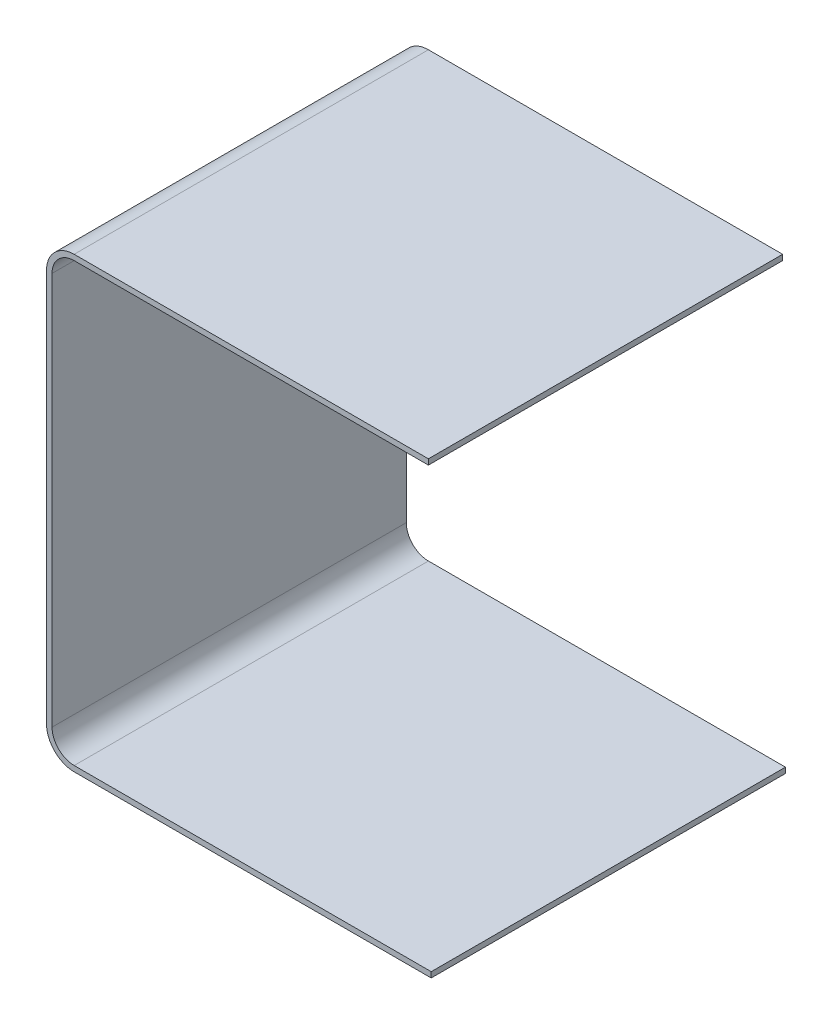
ISO-10303-21;
HEADER;
FILE_DESCRIPTION(('STEP AP214'),'2;1');
FILE_NAME('part.step','',(''),(''),'','','');
FILE_SCHEMA(('AUTOMOTIVE_DESIGN { 1 0 10303 214 1 1 1 1 }'));
ENDSEC;
DATA;
#1=APPLICATION_CONTEXT('core data for automotive mechanical design processes');
#2=APPLICATION_PROTOCOL_DEFINITION('international standard','automotive_design',2000,#1);
#3=PRODUCT_CONTEXT('',#1,'mechanical');
#4=PRODUCT('Part','Part','',(#3));
#5=PRODUCT_RELATED_PRODUCT_CATEGORY('part','',(#4));
#6=PRODUCT_DEFINITION_FORMATION('','',#4);
#7=PRODUCT_DEFINITION_CONTEXT('part definition',#1,'design');
#8=PRODUCT_DEFINITION('design','',#6,#7);
#9=PRODUCT_DEFINITION_SHAPE('','',#8);
#10=(LENGTH_UNIT() NAMED_UNIT(*) SI_UNIT(.MILLI.,.METRE.));
#11=(NAMED_UNIT(*) PLANE_ANGLE_UNIT() SI_UNIT($,.RADIAN.));
#12=(NAMED_UNIT(*) SI_UNIT($,.STERADIAN.) SOLID_ANGLE_UNIT());
#13=UNCERTAINTY_MEASURE_WITH_UNIT(LENGTH_MEASURE(1.E-05),#10,'distance_accuracy_value','');
#14=(GEOMETRIC_REPRESENTATION_CONTEXT(3) GLOBAL_UNCERTAINTY_ASSIGNED_CONTEXT((#13)) GLOBAL_UNIT_ASSIGNED_CONTEXT((#10,
#11,#12)) REPRESENTATION_CONTEXT('',''));
#15=CARTESIAN_POINT('',(0.,0.,0.));
#16=DIRECTION('',(0.,0.,1.));
#17=DIRECTION('',(1.,0.,0.));
#18=AXIS2_PLACEMENT_3D('',#15,#16,#17);
#19=CARTESIAN_POINT('',(261.709177450578,-64.28105,101.6));
#20=DIRECTION('',(0.,1.,0.));
#21=DIRECTION('',(0.,0.,1.));
#22=AXIS2_PLACEMENT_3D('',#19,#20,#21);
#23=PLANE('',#22);
#24=DIRECTION('',(1.,0.,0.));
#25=VECTOR('',#24,1.);
#26=CARTESIAN_POINT('',(261.709177450578,-64.28105,0.));
#27=LINE('',#26,#25);
#28=CARTESIAN_POINT('',(261.709177450578,-64.28105,0.));
#29=VERTEX_POINT('',#28);
#30=CARTESIAN_POINT('',(364.113827615954,-64.28105,0.));
#31=VERTEX_POINT('',#30);
#32=EDGE_CURVE('E122',#29,#31,#27,.T.);
#33=ORIENTED_EDGE('',*,*,#32,.T.);
#34=DIRECTION('',(0.,0.,-1.));
#35=VECTOR('',#34,1.);
#36=CARTESIAN_POINT('',(364.113827615954,-64.28105,101.6));
#37=LINE('',#36,#35);
#38=CARTESIAN_POINT('',(364.113827615954,-64.28105,101.6));
#39=VERTEX_POINT('',#38);
#40=EDGE_CURVE('E11',#39,#31,#37,.T.);
#41=ORIENTED_EDGE('',*,*,#40,.F.);
#42=DIRECTION('',(1.,0.,0.));
#43=VECTOR('',#42,1.);
#44=CARTESIAN_POINT('',(261.709177450578,-64.28105,101.6));
#45=LINE('',#44,#43);
#46=CARTESIAN_POINT('',(261.709177450578,-64.28105,101.6));
#47=VERTEX_POINT('',#46);
#48=EDGE_CURVE('E156',#47,#39,#45,.T.);
#49=ORIENTED_EDGE('',*,*,#48,.F.);
#50=DIRECTION('',(0.,0.,-1.));
#51=VECTOR('',#50,1.);
#52=CARTESIAN_POINT('',(261.709177450578,-64.28105,101.6));
#53=LINE('',#52,#51);
#54=EDGE_CURVE('E123',#47,#29,#53,.T.);
#55=ORIENTED_EDGE('',*,*,#54,.T.);
#56=EDGE_LOOP('',(#33,#41,#49,#55));
#57=FACE_BOUND('',#56,.T.);
#58=ADVANCED_FACE('F24',(#57),#23,.F.);
#59=CARTESIAN_POINT('',(364.113827615954,-62.70625,101.6));
#60=DIRECTION('',(1.,0.,0.));
#61=DIRECTION('',(0.,0.,-1.));
#62=AXIS2_PLACEMENT_3D('',#59,#60,#61);
#63=PLANE('',#62);
#64=DIRECTION('',(0.,-1.,0.));
#65=VECTOR('',#64,1.);
#66=CARTESIAN_POINT('',(364.113827615954,-62.70625,0.));
#67=LINE('',#66,#65);
#68=CARTESIAN_POINT('',(364.113827615954,-62.70625,0.));
#69=VERTEX_POINT('',#68);
#70=EDGE_CURVE('E114',#69,#31,#67,.T.);
#71=ORIENTED_EDGE('',*,*,#70,.F.);
#72=DIRECTION('',(0.,0.,-1.));
#73=VECTOR('',#72,1.);
#74=CARTESIAN_POINT('',(364.113827615954,-62.70625,101.6));
#75=LINE('',#74,#73);
#76=CARTESIAN_POINT('',(364.113827615954,-62.70625,101.6));
#77=VERTEX_POINT('',#76);
#78=EDGE_CURVE('E31',#77,#69,#75,.T.);
#79=ORIENTED_EDGE('',*,*,#78,.F.);
#80=DIRECTION('',(0.,-1.,0.));
#81=VECTOR('',#80,1.);
#82=CARTESIAN_POINT('',(364.113827615954,-62.70625,101.6));
#83=LINE('',#82,#81);
#84=EDGE_CURVE('E117',#77,#39,#83,.T.);
#85=ORIENTED_EDGE('',*,*,#84,.T.);
#86=ORIENTED_EDGE('',*,*,#40,.T.);
#87=EDGE_LOOP('',(#71,#79,#85,#86));
#88=FACE_BOUND('',#87,.T.);
#89=ADVANCED_FACE('F112',(#88),#63,.T.);
#90=CARTESIAN_POINT('',(261.709177450578,-62.70625,101.6));
#91=DIRECTION('',(0.,1.,0.));
#92=DIRECTION('',(0.,0.,1.));
#93=AXIS2_PLACEMENT_3D('',#90,#91,#92);
#94=PLANE('',#93);
#95=DIRECTION('',(1.,0.,0.));
#96=VECTOR('',#95,1.);
#97=CARTESIAN_POINT('',(261.709177450578,-62.70625,0.));
#98=LINE('',#97,#96);
#99=CARTESIAN_POINT('',(261.709177450578,-62.70625,0.));
#100=VERTEX_POINT('',#99);
#101=EDGE_CURVE('E130',#100,#69,#98,.T.);
#102=ORIENTED_EDGE('',*,*,#101,.F.);
#103=DIRECTION('',(0.,0.,-1.));
#104=VECTOR('',#103,1.);
#105=CARTESIAN_POINT('',(261.709177450578,-62.70625,101.6));
#106=LINE('',#105,#104);
#107=CARTESIAN_POINT('',(261.709177450578,-62.70625,101.6));
#108=VERTEX_POINT('',#107);
#109=EDGE_CURVE('E203',#108,#100,#106,.T.);
#110=ORIENTED_EDGE('',*,*,#109,.F.);
#111=DIRECTION('',(1.,0.,0.));
#112=VECTOR('',#111,1.);
#113=CARTESIAN_POINT('',(261.709177450578,-62.70625,101.6));
#114=LINE('',#113,#112);
#115=EDGE_CURVE('E159',#108,#77,#114,.T.);
#116=ORIENTED_EDGE('',*,*,#115,.T.);
#117=ORIENTED_EDGE('',*,*,#78,.T.);
#118=EDGE_LOOP('',(#102,#110,#116,#117));
#119=FACE_BOUND('',#118,.T.);
#120=ADVANCED_FACE('F205',(#119),#94,.T.);
#121=CARTESIAN_POINT('',(261.709177450578,-56.35625,101.6));
#122=DIRECTION('',(0.,0.,-1.));
#123=DIRECTION('',(-1.,0.,0.));
#124=AXIS2_PLACEMENT_3D('',#121,#122,#123);
#125=CYLINDRICAL_SURFACE('',#124,6.35000000000001);
#126=CARTESIAN_POINT('',(261.709177450578,-56.35625,0.));
#127=DIRECTION('',(0.,0.,1.));
#128=DIRECTION('',(1.,0.,0.));
#129=AXIS2_PLACEMENT_3D('',#126,#127,#128);
#130=CIRCLE('',#129,6.35000000000001);
#131=CARTESIAN_POINT('',(255.359177450578,-56.35625,0.));
#132=VERTEX_POINT('',#131);
#133=EDGE_CURVE('E132',#132,#100,#130,.T.);
#134=ORIENTED_EDGE('',*,*,#133,.F.);
#135=DIRECTION('',(0.,0.,-1.));
#136=VECTOR('',#135,1.);
#137=CARTESIAN_POINT('',(255.359177450578,-56.35625,101.6));
#138=LINE('',#137,#136);
#139=CARTESIAN_POINT('',(255.359177450578,-56.35625,101.6));
#140=VERTEX_POINT('',#139);
#141=EDGE_CURVE('E201',#140,#132,#138,.T.);
#142=ORIENTED_EDGE('',*,*,#141,.F.);
#143=CARTESIAN_POINT('',(261.709177450578,-56.35625,101.6));
#144=DIRECTION('',(0.,0.,1.));
#145=DIRECTION('',(1.,0.,0.));
#146=AXIS2_PLACEMENT_3D('',#143,#144,#145);
#147=CIRCLE('',#146,6.35000000000001);
#148=EDGE_CURVE('E162',#140,#108,#147,.T.);
#149=ORIENTED_EDGE('',*,*,#148,.T.);
#150=ORIENTED_EDGE('',*,*,#109,.T.);
#151=EDGE_LOOP('',(#134,#142,#149,#150));
#152=FACE_BOUND('',#151,.T.);
#153=ADVANCED_FACE('F212',(#152),#125,.F.);
#154=CARTESIAN_POINT('',(255.359177450578,56.35625,101.6));
#155=DIRECTION('',(1.,0.,0.));
#156=DIRECTION('',(0.,0.,-1.));
#157=AXIS2_PLACEMENT_3D('',#154,#155,#156);
#158=PLANE('',#157);
#159=DIRECTION('',(0.,-1.,0.));
#160=VECTOR('',#159,1.);
#161=CARTESIAN_POINT('',(255.359177450578,56.35625,0.));
#162=LINE('',#161,#160);
#163=CARTESIAN_POINT('',(255.359177450578,56.35625,0.));
#164=VERTEX_POINT('',#163);
#165=EDGE_CURVE('E136',#164,#132,#162,.T.);
#166=ORIENTED_EDGE('',*,*,#165,.F.);
#167=DIRECTION('',(0.,0.,-1.));
#168=VECTOR('',#167,1.);
#169=CARTESIAN_POINT('',(255.359177450578,56.35625,101.6));
#170=LINE('',#169,#168);
#171=CARTESIAN_POINT('',(255.359177450578,56.35625,101.6));
#172=VERTEX_POINT('',#171);
#173=EDGE_CURVE('E199',#172,#164,#170,.T.);
#174=ORIENTED_EDGE('',*,*,#173,.F.);
#175=DIRECTION('',(0.,-1.,0.));
#176=VECTOR('',#175,1.);
#177=CARTESIAN_POINT('',(255.359177450578,56.35625,101.6));
#178=LINE('',#177,#176);
#179=EDGE_CURVE('E165',#172,#140,#178,.T.);
#180=ORIENTED_EDGE('',*,*,#179,.T.);
#181=ORIENTED_EDGE('',*,*,#141,.T.);
#182=EDGE_LOOP('',(#166,#174,#180,#181));
#183=FACE_BOUND('',#182,.T.);
#184=ADVANCED_FACE('F215',(#183),#158,.T.);
#185=CARTESIAN_POINT('',(261.709177450578,56.35625,101.6));
#186=DIRECTION('',(0.,0.,-1.));
#187=DIRECTION('',(-1.,0.,0.));
#188=AXIS2_PLACEMENT_3D('',#185,#186,#187);
#189=CYLINDRICAL_SURFACE('',#188,6.35000000000002);
#190=CARTESIAN_POINT('',(261.709177450578,56.35625,0.));
#191=DIRECTION('',(0.,0.,1.));
#192=DIRECTION('',(1.,0.,0.));
#193=AXIS2_PLACEMENT_3D('',#190,#191,#192);
#194=CIRCLE('',#193,6.35000000000002);
#195=CARTESIAN_POINT('',(261.709177450578,62.70625,0.));
#196=VERTEX_POINT('',#195);
#197=EDGE_CURVE('E139',#196,#164,#194,.T.);
#198=ORIENTED_EDGE('',*,*,#197,.F.);
#199=DIRECTION('',(0.,0.,-1.));
#200=VECTOR('',#199,1.);
#201=CARTESIAN_POINT('',(261.709177450578,62.70625,101.6));
#202=LINE('',#201,#200);
#203=CARTESIAN_POINT('',(261.709177450578,62.70625,101.6));
#204=VERTEX_POINT('',#203);
#205=EDGE_CURVE('E197',#204,#196,#202,.T.);
#206=ORIENTED_EDGE('',*,*,#205,.F.);
#207=CARTESIAN_POINT('',(261.709177450578,56.35625,101.6));
#208=DIRECTION('',(0.,0.,1.));
#209=DIRECTION('',(1.,0.,0.));
#210=AXIS2_PLACEMENT_3D('',#207,#208,#209);
#211=CIRCLE('',#210,6.35000000000002);
#212=EDGE_CURVE('E168',#204,#172,#211,.T.);
#213=ORIENTED_EDGE('',*,*,#212,.T.);
#214=ORIENTED_EDGE('',*,*,#173,.T.);
#215=EDGE_LOOP('',(#198,#206,#213,#214));
#216=FACE_BOUND('',#215,.T.);
#217=ADVANCED_FACE('F220',(#216),#189,.F.);
#218=CARTESIAN_POINT('',(261.709177450578,62.70625,101.6));
#219=DIRECTION('',(0.,-1.,0.));
#220=DIRECTION('',(1.,0.,0.));
#221=AXIS2_PLACEMENT_3D('',#218,#219,#220);
#222=PLANE('',#221);
#223=DIRECTION('',(-1.,0.,0.));
#224=VECTOR('',#223,1.);
#225=CARTESIAN_POINT('',(261.709177450578,62.70625,0.));
#226=LINE('',#225,#224);
#227=CARTESIAN_POINT('',(363.309177450578,62.70625,0.));
#228=VERTEX_POINT('',#227);
#229=EDGE_CURVE('E142',#228,#196,#226,.T.);
#230=ORIENTED_EDGE('',*,*,#229,.F.);
#231=DIRECTION('',(0.,0.,-1.));
#232=VECTOR('',#231,1.);
#233=CARTESIAN_POINT('',(363.309177450578,62.70625,101.6));
#234=LINE('',#233,#232);
#235=CARTESIAN_POINT('',(363.309177450578,62.70625,101.6));
#236=VERTEX_POINT('',#235);
#237=EDGE_CURVE('E195',#236,#228,#234,.T.);
#238=ORIENTED_EDGE('',*,*,#237,.F.);
#239=DIRECTION('',(-1.,0.,0.));
#240=VECTOR('',#239,1.);
#241=CARTESIAN_POINT('',(261.709177450578,62.70625,101.6));
#242=LINE('',#241,#240);
#243=EDGE_CURVE('E171',#236,#204,#242,.T.);
#244=ORIENTED_EDGE('',*,*,#243,.T.);
#245=ORIENTED_EDGE('',*,*,#205,.T.);
#246=EDGE_LOOP('',(#230,#238,#244,#245));
#247=FACE_BOUND('',#246,.T.);
#248=ADVANCED_FACE('F223',(#247),#222,.T.);
#249=CARTESIAN_POINT('',(363.309177450578,64.28105,101.6));
#250=DIRECTION('',(1.,0.,0.));
#251=DIRECTION('',(0.,0.,-1.));
#252=AXIS2_PLACEMENT_3D('',#249,#250,#251);
#253=PLANE('',#252);
#254=DIRECTION('',(0.,-1.,0.));
#255=VECTOR('',#254,1.);
#256=CARTESIAN_POINT('',(363.309177450578,64.28105,0.));
#257=LINE('',#256,#255);
#258=CARTESIAN_POINT('',(363.309177450578,64.28105,0.));
#259=VERTEX_POINT('',#258);
#260=EDGE_CURVE('E145',#259,#228,#257,.T.);
#261=ORIENTED_EDGE('',*,*,#260,.F.);
#262=DIRECTION('',(0.,0.,-1.));
#263=VECTOR('',#262,1.);
#264=CARTESIAN_POINT('',(363.309177450578,64.28105,101.6));
#265=LINE('',#264,#263);
#266=CARTESIAN_POINT('',(363.309177450578,64.28105,101.6));
#267=VERTEX_POINT('',#266);
#268=EDGE_CURVE('E193',#267,#259,#265,.T.);
#269=ORIENTED_EDGE('',*,*,#268,.F.);
#270=DIRECTION('',(0.,-1.,0.));
#271=VECTOR('',#270,1.);
#272=CARTESIAN_POINT('',(363.309177450578,64.28105,101.6));
#273=LINE('',#272,#271);
#274=EDGE_CURVE('E174',#267,#236,#273,.T.);
#275=ORIENTED_EDGE('',*,*,#274,.T.);
#276=ORIENTED_EDGE('',*,*,#237,.T.);
#277=EDGE_LOOP('',(#261,#269,#275,#276));
#278=FACE_BOUND('',#277,.T.);
#279=ADVANCED_FACE('F227',(#278),#253,.T.);
#280=CARTESIAN_POINT('',(261.709177450578,64.28105,101.6));
#281=DIRECTION('',(0.,-1.,0.));
#282=DIRECTION('',(1.,0.,0.));
#283=AXIS2_PLACEMENT_3D('',#280,#281,#282);
#284=PLANE('',#283);
#285=DIRECTION('',(-1.,0.,0.));
#286=VECTOR('',#285,1.);
#287=CARTESIAN_POINT('',(261.709177450578,64.28105,0.));
#288=LINE('',#287,#286);
#289=CARTESIAN_POINT('',(261.709177450578,64.28105,0.));
#290=VERTEX_POINT('',#289);
#291=EDGE_CURVE('E148',#259,#290,#288,.T.);
#292=ORIENTED_EDGE('',*,*,#291,.T.);
#293=DIRECTION('',(0.,0.,-1.));
#294=VECTOR('',#293,1.);
#295=CARTESIAN_POINT('',(261.709177450578,64.28105,101.6));
#296=LINE('',#295,#294);
#297=CARTESIAN_POINT('',(261.709177450578,64.28105,101.6));
#298=VERTEX_POINT('',#297);
#299=EDGE_CURVE('E190',#298,#290,#296,.T.);
#300=ORIENTED_EDGE('',*,*,#299,.F.);
#301=DIRECTION('',(-1.,0.,0.));
#302=VECTOR('',#301,1.);
#303=CARTESIAN_POINT('',(261.709177450578,64.28105,101.6));
#304=LINE('',#303,#302);
#305=EDGE_CURVE('E177',#267,#298,#304,.T.);
#306=ORIENTED_EDGE('',*,*,#305,.F.);
#307=ORIENTED_EDGE('',*,*,#268,.T.);
#308=EDGE_LOOP('',(#292,#300,#306,#307));
#309=FACE_BOUND('',#308,.T.);
#310=ADVANCED_FACE('F232',(#309),#284,.F.);
#311=CARTESIAN_POINT('',(261.709177450578,56.35625,101.6));
#312=DIRECTION('',(0.,0.,-1.));
#313=DIRECTION('',(-1.,0.,0.));
#314=AXIS2_PLACEMENT_3D('',#311,#312,#313);
#315=CYLINDRICAL_SURFACE('',#314,7.92480000000002);
#316=CARTESIAN_POINT('',(261.709177450578,56.35625,0.));
#317=DIRECTION('',(0.,0.,1.));
#318=DIRECTION('',(1.,0.,0.));
#319=AXIS2_PLACEMENT_3D('',#316,#317,#318);
#320=CIRCLE('',#319,7.92480000000002);
#321=CARTESIAN_POINT('',(253.784377450578,56.35625,0.));
#322=VERTEX_POINT('',#321);
#323=EDGE_CURVE('E150',#290,#322,#320,.T.);
#324=ORIENTED_EDGE('',*,*,#323,.T.);
#325=DIRECTION('',(0.,0.,-1.));
#326=VECTOR('',#325,1.);
#327=CARTESIAN_POINT('',(253.784377450578,56.35625,101.6));
#328=LINE('',#327,#326);
#329=CARTESIAN_POINT('',(253.784377450578,56.35625,101.6));
#330=VERTEX_POINT('',#329);
#331=EDGE_CURVE('E187',#330,#322,#328,.T.);
#332=ORIENTED_EDGE('',*,*,#331,.F.);
#333=CARTESIAN_POINT('',(261.709177450578,56.35625,101.6));
#334=DIRECTION('',(0.,0.,1.));
#335=DIRECTION('',(1.,0.,0.));
#336=AXIS2_PLACEMENT_3D('',#333,#334,#335);
#337=CIRCLE('',#336,7.92480000000002);
#338=EDGE_CURVE('E179',#298,#330,#337,.T.);
#339=ORIENTED_EDGE('',*,*,#338,.F.);
#340=ORIENTED_EDGE('',*,*,#299,.T.);
#341=EDGE_LOOP('',(#324,#332,#339,#340));
#342=FACE_BOUND('',#341,.T.);
#343=ADVANCED_FACE('F236',(#342),#315,.T.);
#344=CARTESIAN_POINT('',(253.784377450578,56.35625,101.6));
#345=DIRECTION('',(1.,0.,0.));
#346=DIRECTION('',(0.,0.,-1.));
#347=AXIS2_PLACEMENT_3D('',#344,#345,#346);
#348=PLANE('',#347);
#349=DIRECTION('',(0.,1.,0.));
#350=VECTOR('',#349,1.);
#351=CARTESIAN_POINT('',(253.784377450578,56.35625,0.));
#352=LINE('',#351,#350);
#353=CARTESIAN_POINT('',(253.784377450578,-56.35625,0.));
#354=VERTEX_POINT('',#353);
#355=EDGE_CURVE('E152',#322,#354,#352,.F.);
#356=ORIENTED_EDGE('',*,*,#355,.T.);
#357=DIRECTION('',(0.,0.,-1.));
#358=VECTOR('',#357,1.);
#359=CARTESIAN_POINT('',(253.784377450578,-56.35625,101.6));
#360=LINE('',#359,#358);
#361=CARTESIAN_POINT('',(253.784377450578,-56.35625,101.6));
#362=VERTEX_POINT('',#361);
#363=EDGE_CURVE('E184',#362,#354,#360,.T.);
#364=ORIENTED_EDGE('',*,*,#363,.F.);
#365=DIRECTION('',(0.,1.,0.));
#366=VECTOR('',#365,1.);
#367=CARTESIAN_POINT('',(253.784377450578,56.35625,101.6));
#368=LINE('',#367,#366);
#369=EDGE_CURVE('E43',#330,#362,#368,.F.);
#370=ORIENTED_EDGE('',*,*,#369,.F.);
#371=ORIENTED_EDGE('',*,*,#331,.T.);
#372=EDGE_LOOP('',(#356,#364,#370,#371));
#373=FACE_BOUND('',#372,.T.);
#374=ADVANCED_FACE('F240',(#373),#348,.F.);
#375=CARTESIAN_POINT('',(261.709177450578,-56.35625,101.6));
#376=DIRECTION('',(0.,0.,-1.));
#377=DIRECTION('',(-1.,0.,0.));
#378=AXIS2_PLACEMENT_3D('',#375,#376,#377);
#379=CYLINDRICAL_SURFACE('',#378,7.92480000000001);
#380=CARTESIAN_POINT('',(261.709177450578,-56.35625,0.));
#381=DIRECTION('',(0.,0.,1.));
#382=DIRECTION('',(1.,0.,0.));
#383=AXIS2_PLACEMENT_3D('',#380,#381,#382);
#384=CIRCLE('',#383,7.92480000000001);
#385=EDGE_CURVE('E154',#354,#29,#384,.T.);
#386=ORIENTED_EDGE('',*,*,#385,.T.);
#387=ORIENTED_EDGE('',*,*,#54,.F.);
#388=CARTESIAN_POINT('',(261.709177450578,-56.35625,101.6));
#389=DIRECTION('',(0.,0.,1.));
#390=DIRECTION('',(1.,0.,0.));
#391=AXIS2_PLACEMENT_3D('',#388,#389,#390);
#392=CIRCLE('',#391,7.92480000000001);
#393=EDGE_CURVE('E38',#362,#47,#392,.T.);
#394=ORIENTED_EDGE('',*,*,#393,.F.);
#395=ORIENTED_EDGE('',*,*,#363,.T.);
#396=EDGE_LOOP('',(#386,#387,#394,#395));
#397=FACE_BOUND('',#396,.T.);
#398=ADVANCED_FACE('F242',(#397),#379,.T.);
#399=CARTESIAN_POINT('',(261.709177450578,-56.35625,101.6));
#400=DIRECTION('',(0.,0.,1.));
#401=DIRECTION('',(1.,0.,0.));
#402=AXIS2_PLACEMENT_3D('',#399,#400,#401);
#403=PLANE('',#402);
#404=ORIENTED_EDGE('',*,*,#48,.T.);
#405=ORIENTED_EDGE('',*,*,#84,.F.);
#406=ORIENTED_EDGE('',*,*,#115,.F.);
#407=ORIENTED_EDGE('',*,*,#148,.F.);
#408=ORIENTED_EDGE('',*,*,#179,.F.);
#409=ORIENTED_EDGE('',*,*,#212,.F.);
#410=ORIENTED_EDGE('',*,*,#243,.F.);
#411=ORIENTED_EDGE('',*,*,#274,.F.);
#412=ORIENTED_EDGE('',*,*,#305,.T.);
#413=ORIENTED_EDGE('',*,*,#338,.T.);
#414=ORIENTED_EDGE('',*,*,#369,.T.);
#415=ORIENTED_EDGE('',*,*,#393,.T.);
#416=EDGE_LOOP('',(#404,#405,#406,#407,#408,#409,#410,#411,#412,#413,#414,#415));
#417=FACE_BOUND('',#416,.T.);
#418=ADVANCED_FACE('F207',(#417),#403,.T.);
#419=CARTESIAN_POINT('',(261.709177450578,-56.35625,0.));
#420=DIRECTION('',(0.,0.,1.));
#421=DIRECTION('',(1.,0.,0.));
#422=AXIS2_PLACEMENT_3D('',#419,#420,#421);
#423=PLANE('',#422);
#424=ORIENTED_EDGE('',*,*,#32,.F.);
#425=ORIENTED_EDGE('',*,*,#385,.F.);
#426=ORIENTED_EDGE('',*,*,#355,.F.);
#427=ORIENTED_EDGE('',*,*,#323,.F.);
#428=ORIENTED_EDGE('',*,*,#291,.F.);
#429=ORIENTED_EDGE('',*,*,#260,.T.);
#430=ORIENTED_EDGE('',*,*,#229,.T.);
#431=ORIENTED_EDGE('',*,*,#197,.T.);
#432=ORIENTED_EDGE('',*,*,#165,.T.);
#433=ORIENTED_EDGE('',*,*,#133,.T.);
#434=ORIENTED_EDGE('',*,*,#101,.T.);
#435=ORIENTED_EDGE('',*,*,#70,.T.);
#436=EDGE_LOOP('',(#424,#425,#426,#427,#428,#429,#430,#431,#432,#433,#434,#435));
#437=FACE_BOUND('',#436,.T.);
#438=ADVANCED_FACE('F127',(#437),#423,.F.);
#439=CLOSED_SHELL('',(#58,#89,#120,#153,#184,#217,#248,#279,#310,#343,#374,#398,#418,#438));
#440=MANIFOLD_SOLID_BREP('B2',#439);
#441=ADVANCED_BREP_SHAPE_REPRESENTATION('',(#18,#440),#14);
#442=SHAPE_DEFINITION_REPRESENTATION(#9,#441);
ENDSEC;
END-ISO-10303-21;
